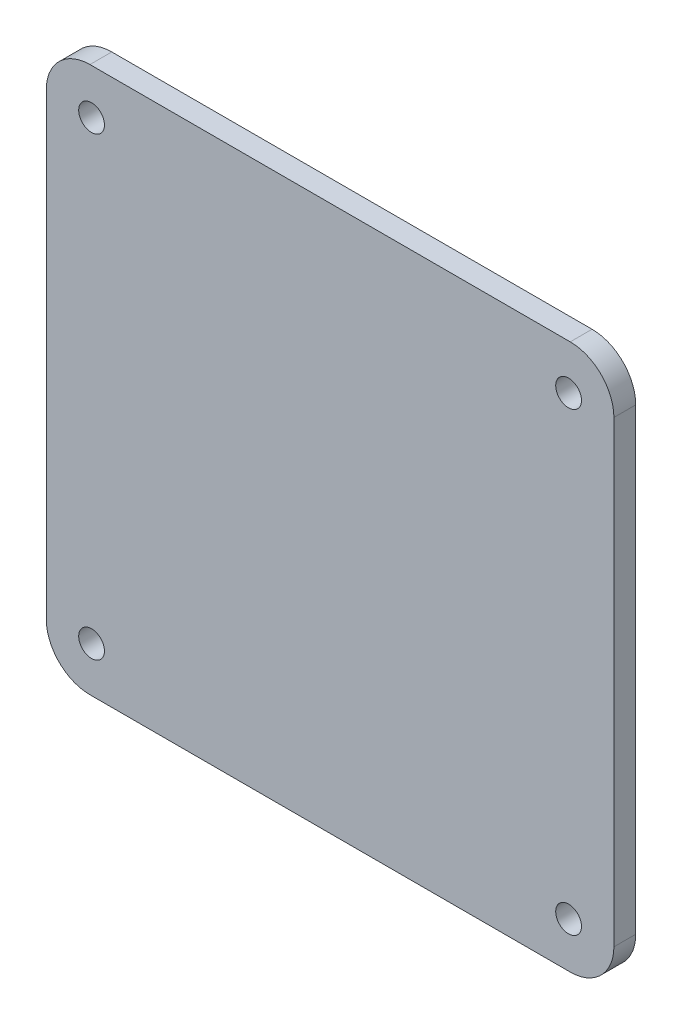
ISO-10303-21;
HEADER;
FILE_DESCRIPTION(('STEP AP214'),'2;1');
FILE_NAME('part.step','',(''),(''),'','','');
FILE_SCHEMA(('AUTOMOTIVE_DESIGN { 1 0 10303 214 1 1 1 1 }'));
ENDSEC;
DATA;
#1=APPLICATION_CONTEXT('core data for automotive mechanical design processes');
#2=APPLICATION_PROTOCOL_DEFINITION('international standard','automotive_design',2000,#1);
#3=PRODUCT_CONTEXT('',#1,'mechanical');
#4=PRODUCT('Part','Part','',(#3));
#5=PRODUCT_RELATED_PRODUCT_CATEGORY('part','',(#4));
#6=PRODUCT_DEFINITION_FORMATION('','',#4);
#7=PRODUCT_DEFINITION_CONTEXT('part definition',#1,'design');
#8=PRODUCT_DEFINITION('design','',#6,#7);
#9=PRODUCT_DEFINITION_SHAPE('','',#8);
#10=(LENGTH_UNIT() NAMED_UNIT(*) SI_UNIT(.MILLI.,.METRE.));
#11=(NAMED_UNIT(*) PLANE_ANGLE_UNIT() SI_UNIT($,.RADIAN.));
#12=(NAMED_UNIT(*) SI_UNIT($,.STERADIAN.) SOLID_ANGLE_UNIT());
#13=UNCERTAINTY_MEASURE_WITH_UNIT(LENGTH_MEASURE(1.E-05),#10,'distance_accuracy_value','');
#14=(GEOMETRIC_REPRESENTATION_CONTEXT(3) GLOBAL_UNCERTAINTY_ASSIGNED_CONTEXT((#13)) GLOBAL_UNIT_ASSIGNED_CONTEXT((#10,
#11,#12)) REPRESENTATION_CONTEXT('',''));
#15=CARTESIAN_POINT('',(0.,0.,0.));
#16=DIRECTION('',(0.,0.,1.));
#17=DIRECTION('',(1.,0.,0.));
#18=AXIS2_PLACEMENT_3D('',#15,#16,#17);
#19=CARTESIAN_POINT('',(-27.94,-26.67,2.54));
#20=DIRECTION('',(0.,0.,-1.));
#21=DIRECTION('',(-1.,0.,0.));
#22=AXIS2_PLACEMENT_3D('',#19,#20,#21);
#23=CYLINDRICAL_SURFACE('',#22,5.08);
#24=CARTESIAN_POINT('',(-27.94,-26.67,0.));
#25=DIRECTION('',(0.,0.,1.));
#26=DIRECTION('',(-1.,0.,0.));
#27=AXIS2_PLACEMENT_3D('',#24,#25,#26);
#28=CIRCLE('',#27,5.08);
#29=CARTESIAN_POINT('',(-33.02,-26.67,0.));
#30=VERTEX_POINT('',#29);
#31=CARTESIAN_POINT('',(-27.94,-31.75,0.));
#32=VERTEX_POINT('',#31);
#33=EDGE_CURVE('E145',#30,#32,#28,.T.);
#34=ORIENTED_EDGE('',*,*,#33,.T.);
#35=DIRECTION('',(0.,0.,-1.));
#36=VECTOR('',#35,1.);
#37=CARTESIAN_POINT('',(-27.94,-31.75,2.54));
#38=LINE('',#37,#36);
#39=CARTESIAN_POINT('',(-27.94,-31.75,2.54));
#40=VERTEX_POINT('',#39);
#41=EDGE_CURVE('E11',#40,#32,#38,.T.);
#42=ORIENTED_EDGE('',*,*,#41,.F.);
#43=CARTESIAN_POINT('',(-27.94,-26.67,2.54));
#44=DIRECTION('',(0.,0.,1.));
#45=DIRECTION('',(-1.,0.,0.));
#46=AXIS2_PLACEMENT_3D('',#43,#44,#45);
#47=CIRCLE('',#46,5.08);
#48=CARTESIAN_POINT('',(-33.02,-26.67,2.54));
#49=VERTEX_POINT('',#48);
#50=EDGE_CURVE('E168',#49,#40,#47,.T.);
#51=ORIENTED_EDGE('',*,*,#50,.F.);
#52=DIRECTION('',(0.,0.,-1.));
#53=VECTOR('',#52,1.);
#54=CARTESIAN_POINT('',(-33.02,-26.67,2.54));
#55=LINE('',#54,#53);
#56=EDGE_CURVE('E141',#49,#30,#55,.T.);
#57=ORIENTED_EDGE('',*,*,#56,.T.);
#58=EDGE_LOOP('',(#34,#42,#51,#57));
#59=FACE_BOUND('',#58,.T.);
#60=ADVANCED_FACE('F44',(#59),#23,.T.);
#61=CARTESIAN_POINT('',(-27.94,-31.75,2.54));
#62=DIRECTION('',(0.,1.,0.));
#63=DIRECTION('',(0.,0.,1.));
#64=AXIS2_PLACEMENT_3D('',#61,#62,#63);
#65=PLANE('',#64);
#66=DIRECTION('',(1.,0.,0.));
#67=VECTOR('',#66,1.);
#68=CARTESIAN_POINT('',(-27.94,-31.75,0.));
#69=LINE('',#68,#67);
#70=CARTESIAN_POINT('',(27.94,-31.75,0.));
#71=VERTEX_POINT('',#70);
#72=EDGE_CURVE('E149',#32,#71,#69,.T.);
#73=ORIENTED_EDGE('',*,*,#72,.T.);
#74=DIRECTION('',(0.,0.,-1.));
#75=VECTOR('',#74,1.);
#76=CARTESIAN_POINT('',(27.94,-31.75,2.54));
#77=LINE('',#76,#75);
#78=CARTESIAN_POINT('',(27.94,-31.75,2.54));
#79=VERTEX_POINT('',#78);
#80=EDGE_CURVE('E53',#79,#71,#77,.T.);
#81=ORIENTED_EDGE('',*,*,#80,.F.);
#82=DIRECTION('',(1.,0.,0.));
#83=VECTOR('',#82,1.);
#84=CARTESIAN_POINT('',(-27.94,-31.75,2.54));
#85=LINE('',#84,#83);
#86=EDGE_CURVE('E104',#40,#79,#85,.T.);
#87=ORIENTED_EDGE('',*,*,#86,.F.);
#88=ORIENTED_EDGE('',*,*,#41,.T.);
#89=EDGE_LOOP('',(#73,#81,#87,#88));
#90=FACE_BOUND('',#89,.T.);
#91=ADVANCED_FACE('F269',(#90),#65,.F.);
#92=CARTESIAN_POINT('',(27.94,-26.67,2.54));
#93=DIRECTION('',(0.,0.,-1.));
#94=DIRECTION('',(-1.,0.,0.));
#95=AXIS2_PLACEMENT_3D('',#92,#93,#94);
#96=CYLINDRICAL_SURFACE('',#95,5.08);
#97=CARTESIAN_POINT('',(27.94,-26.67,0.));
#98=DIRECTION('',(0.,0.,1.));
#99=DIRECTION('',(1.,0.,0.));
#100=AXIS2_PLACEMENT_3D('',#97,#98,#99);
#101=CIRCLE('',#100,5.08);
#102=CARTESIAN_POINT('',(33.02,-26.67,0.));
#103=VERTEX_POINT('',#102);
#104=EDGE_CURVE('E153',#71,#103,#101,.T.);
#105=ORIENTED_EDGE('',*,*,#104,.T.);
#106=DIRECTION('',(0.,0.,-1.));
#107=VECTOR('',#106,1.);
#108=CARTESIAN_POINT('',(33.02,-26.67,2.54));
#109=LINE('',#108,#107);
#110=CARTESIAN_POINT('',(33.02,-26.67,2.54));
#111=VERTEX_POINT('',#110);
#112=EDGE_CURVE('E179',#111,#103,#109,.T.);
#113=ORIENTED_EDGE('',*,*,#112,.F.);
#114=CARTESIAN_POINT('',(27.94,-26.67,2.54));
#115=DIRECTION('',(0.,0.,1.));
#116=DIRECTION('',(1.,0.,0.));
#117=AXIS2_PLACEMENT_3D('',#114,#115,#116);
#118=CIRCLE('',#117,5.08);
#119=EDGE_CURVE('E189',#79,#111,#118,.T.);
#120=ORIENTED_EDGE('',*,*,#119,.F.);
#121=ORIENTED_EDGE('',*,*,#80,.T.);
#122=EDGE_LOOP('',(#105,#113,#120,#121));
#123=FACE_BOUND('',#122,.T.);
#124=ADVANCED_FACE('F187',(#123),#96,.T.);
#125=CARTESIAN_POINT('',(33.02,-26.67,2.54));
#126=DIRECTION('',(-1.,0.,0.));
#127=DIRECTION('',(0.,0.,1.));
#128=AXIS2_PLACEMENT_3D('',#125,#126,#127);
#129=PLANE('',#128);
#130=DIRECTION('',(0.,1.,0.));
#131=VECTOR('',#130,1.);
#132=CARTESIAN_POINT('',(33.02,-26.67,0.));
#133=LINE('',#132,#131);
#134=CARTESIAN_POINT('',(33.02,26.67,0.));
#135=VERTEX_POINT('',#134);
#136=EDGE_CURVE('E156',#103,#135,#133,.T.);
#137=ORIENTED_EDGE('',*,*,#136,.T.);
#138=DIRECTION('',(0.,0.,-1.));
#139=VECTOR('',#138,1.);
#140=CARTESIAN_POINT('',(33.02,26.67,2.54));
#141=LINE('',#140,#139);
#142=CARTESIAN_POINT('',(33.02,26.67,2.54));
#143=VERTEX_POINT('',#142);
#144=EDGE_CURVE('E175',#143,#135,#141,.T.);
#145=ORIENTED_EDGE('',*,*,#144,.F.);
#146=DIRECTION('',(0.,1.,0.));
#147=VECTOR('',#146,1.);
#148=CARTESIAN_POINT('',(33.02,-26.67,2.54));
#149=LINE('',#148,#147);
#150=EDGE_CURVE('E202',#111,#143,#149,.T.);
#151=ORIENTED_EDGE('',*,*,#150,.F.);
#152=ORIENTED_EDGE('',*,*,#112,.T.);
#153=EDGE_LOOP('',(#137,#145,#151,#152));
#154=FACE_BOUND('',#153,.T.);
#155=ADVANCED_FACE('F197',(#154),#129,.F.);
#156=CARTESIAN_POINT('',(27.94,26.67,2.54));
#157=DIRECTION('',(0.,0.,-1.));
#158=DIRECTION('',(-1.,0.,0.));
#159=AXIS2_PLACEMENT_3D('',#156,#157,#158);
#160=CYLINDRICAL_SURFACE('',#159,5.08);
#161=CARTESIAN_POINT('',(27.94,26.67,0.));
#162=DIRECTION('',(0.,0.,1.));
#163=DIRECTION('',(-1.,0.,0.));
#164=AXIS2_PLACEMENT_3D('',#161,#162,#163);
#165=CIRCLE('',#164,5.08);
#166=CARTESIAN_POINT('',(27.94,31.75,0.));
#167=VERTEX_POINT('',#166);
#168=EDGE_CURVE('E159',#135,#167,#165,.T.);
#169=ORIENTED_EDGE('',*,*,#168,.T.);
#170=DIRECTION('',(0.,0.,-1.));
#171=VECTOR('',#170,1.);
#172=CARTESIAN_POINT('',(27.94,31.75,2.54));
#173=LINE('',#172,#171);
#174=CARTESIAN_POINT('',(27.94,31.75,2.54));
#175=VERTEX_POINT('',#174);
#176=EDGE_CURVE('E134',#175,#167,#173,.T.);
#177=ORIENTED_EDGE('',*,*,#176,.F.);
#178=CARTESIAN_POINT('',(27.94,26.67,2.54));
#179=DIRECTION('',(0.,0.,1.));
#180=DIRECTION('',(-1.,0.,0.));
#181=AXIS2_PLACEMENT_3D('',#178,#179,#180);
#182=CIRCLE('',#181,5.08);
#183=EDGE_CURVE('E123',#143,#175,#182,.T.);
#184=ORIENTED_EDGE('',*,*,#183,.F.);
#185=ORIENTED_EDGE('',*,*,#144,.T.);
#186=EDGE_LOOP('',(#169,#177,#184,#185));
#187=FACE_BOUND('',#186,.T.);
#188=ADVANCED_FACE('F200',(#187),#160,.T.);
#189=CARTESIAN_POINT('',(-27.94,31.75,2.54));
#190=DIRECTION('',(0.,-1.,0.));
#191=DIRECTION('',(0.,0.,-1.));
#192=AXIS2_PLACEMENT_3D('',#189,#190,#191);
#193=PLANE('',#192);
#194=DIRECTION('',(-1.,0.,0.));
#195=VECTOR('',#194,1.);
#196=CARTESIAN_POINT('',(-27.94,31.75,0.));
#197=LINE('',#196,#195);
#198=CARTESIAN_POINT('',(-27.94,31.75,0.));
#199=VERTEX_POINT('',#198);
#200=EDGE_CURVE('E132',#167,#199,#197,.T.);
#201=ORIENTED_EDGE('',*,*,#200,.T.);
#202=DIRECTION('',(0.,0.,-1.));
#203=VECTOR('',#202,1.);
#204=CARTESIAN_POINT('',(-27.94,31.75,2.54));
#205=LINE('',#204,#203);
#206=CARTESIAN_POINT('',(-27.94,31.75,2.54));
#207=VERTEX_POINT('',#206);
#208=EDGE_CURVE('E129',#207,#199,#205,.T.);
#209=ORIENTED_EDGE('',*,*,#208,.F.);
#210=DIRECTION('',(-1.,0.,0.));
#211=VECTOR('',#210,1.);
#212=CARTESIAN_POINT('',(-27.94,31.75,2.54));
#213=LINE('',#212,#211);
#214=EDGE_CURVE('E117',#175,#207,#213,.T.);
#215=ORIENTED_EDGE('',*,*,#214,.F.);
#216=ORIENTED_EDGE('',*,*,#176,.T.);
#217=EDGE_LOOP('',(#201,#209,#215,#216));
#218=FACE_BOUND('',#217,.T.);
#219=ADVANCED_FACE('F130',(#218),#193,.F.);
#220=CARTESIAN_POINT('',(-27.94,26.67,2.54));
#221=DIRECTION('',(0.,0.,-1.));
#222=DIRECTION('',(-1.,0.,0.));
#223=AXIS2_PLACEMENT_3D('',#220,#221,#222);
#224=CYLINDRICAL_SURFACE('',#223,5.08);
#225=CARTESIAN_POINT('',(-27.94,26.67,0.));
#226=DIRECTION('',(0.,0.,1.));
#227=DIRECTION('',(-1.,0.,0.));
#228=AXIS2_PLACEMENT_3D('',#225,#226,#227);
#229=CIRCLE('',#228,5.08);
#230=CARTESIAN_POINT('',(-33.02,26.67,0.));
#231=VERTEX_POINT('',#230);
#232=EDGE_CURVE('E90',#199,#231,#229,.T.);
#233=ORIENTED_EDGE('',*,*,#232,.T.);
#234=DIRECTION('',(0.,0.,-1.));
#235=VECTOR('',#234,1.);
#236=CARTESIAN_POINT('',(-33.02,26.67,2.54));
#237=LINE('',#236,#235);
#238=CARTESIAN_POINT('',(-33.02,26.67,2.54));
#239=VERTEX_POINT('',#238);
#240=EDGE_CURVE('E135',#239,#231,#237,.T.);
#241=ORIENTED_EDGE('',*,*,#240,.F.);
#242=CARTESIAN_POINT('',(-27.94,26.67,2.54));
#243=DIRECTION('',(0.,0.,1.));
#244=DIRECTION('',(-1.,0.,0.));
#245=AXIS2_PLACEMENT_3D('',#242,#243,#244);
#246=CIRCLE('',#245,5.08);
#247=EDGE_CURVE('E121',#207,#239,#246,.T.);
#248=ORIENTED_EDGE('',*,*,#247,.F.);
#249=ORIENTED_EDGE('',*,*,#208,.T.);
#250=EDGE_LOOP('',(#233,#241,#248,#249));
#251=FACE_BOUND('',#250,.T.);
#252=ADVANCED_FACE('F137',(#251),#224,.T.);
#253=CARTESIAN_POINT('',(-33.02,-26.67,2.54));
#254=DIRECTION('',(1.,0.,0.));
#255=DIRECTION('',(0.,0.,-1.));
#256=AXIS2_PLACEMENT_3D('',#253,#254,#255);
#257=PLANE('',#256);
#258=DIRECTION('',(0.,-1.,0.));
#259=VECTOR('',#258,1.);
#260=CARTESIAN_POINT('',(-33.02,-26.67,0.));
#261=LINE('',#260,#259);
#262=EDGE_CURVE('E96',#231,#30,#261,.T.);
#263=ORIENTED_EDGE('',*,*,#262,.T.);
#264=ORIENTED_EDGE('',*,*,#56,.F.);
#265=DIRECTION('',(0.,-1.,0.));
#266=VECTOR('',#265,1.);
#267=CARTESIAN_POINT('',(-33.02,-26.67,2.54));
#268=LINE('',#267,#266);
#269=EDGE_CURVE('E61',#239,#49,#268,.T.);
#270=ORIENTED_EDGE('',*,*,#269,.F.);
#271=ORIENTED_EDGE('',*,*,#240,.T.);
#272=EDGE_LOOP('',(#263,#264,#270,#271));
#273=FACE_BOUND('',#272,.T.);
#274=ADVANCED_FACE('F248',(#273),#257,.F.);
#275=CARTESIAN_POINT('',(-27.94,-26.67,2.54));
#276=DIRECTION('',(0.,0.,-1.));
#277=DIRECTION('',(-1.,0.,0.));
#278=AXIS2_PLACEMENT_3D('',#275,#276,#277);
#279=PLANE('',#278);
#280=CARTESIAN_POINT('',(27.75,26.5,2.54));
#281=DIRECTION('',(0.,0.,1.));
#282=DIRECTION('',(1.,0.,0.));
#283=AXIS2_PLACEMENT_3D('',#280,#281,#282);
#284=CIRCLE('',#283,1.5);
#285=CARTESIAN_POINT('',(29.25,26.5,2.54));
#286=VERTEX_POINT('',#285);
#287=EDGE_CURVE('E216',#286,#286,#284,.T.);
#288=ORIENTED_EDGE('',*,*,#287,.F.);
#289=EDGE_LOOP('',(#288));
#290=FACE_BOUND('',#289,.T.);
#291=CARTESIAN_POINT('',(-27.75,-26.5,2.54));
#292=DIRECTION('',(0.,0.,1.));
#293=DIRECTION('',(1.,0.,0.));
#294=AXIS2_PLACEMENT_3D('',#291,#292,#293);
#295=CIRCLE('',#294,1.5);
#296=CARTESIAN_POINT('',(-26.25,-26.5,2.54));
#297=VERTEX_POINT('',#296);
#298=EDGE_CURVE('E224',#297,#297,#295,.T.);
#299=ORIENTED_EDGE('',*,*,#298,.F.);
#300=EDGE_LOOP('',(#299));
#301=FACE_BOUND('',#300,.T.);
#302=CARTESIAN_POINT('',(27.75,-26.5,2.54));
#303=DIRECTION('',(0.,0.,1.));
#304=DIRECTION('',(1.,0.,0.));
#305=AXIS2_PLACEMENT_3D('',#302,#303,#304);
#306=CIRCLE('',#305,1.5);
#307=CARTESIAN_POINT('',(29.25,-26.5,2.54));
#308=VERTEX_POINT('',#307);
#309=EDGE_CURVE('E225',#308,#308,#306,.T.);
#310=ORIENTED_EDGE('',*,*,#309,.F.);
#311=EDGE_LOOP('',(#310));
#312=FACE_BOUND('',#311,.T.);
#313=CARTESIAN_POINT('',(-27.75,26.5,2.54));
#314=DIRECTION('',(0.,0.,1.));
#315=DIRECTION('',(1.,0.,0.));
#316=AXIS2_PLACEMENT_3D('',#313,#314,#315);
#317=CIRCLE('',#316,1.5);
#318=CARTESIAN_POINT('',(-26.25,26.5,2.54));
#319=VERTEX_POINT('',#318);
#320=EDGE_CURVE('E212',#319,#319,#317,.T.);
#321=ORIENTED_EDGE('',*,*,#320,.F.);
#322=EDGE_LOOP('',(#321));
#323=FACE_BOUND('',#322,.T.);
#324=ORIENTED_EDGE('',*,*,#50,.T.);
#325=ORIENTED_EDGE('',*,*,#86,.T.);
#326=ORIENTED_EDGE('',*,*,#119,.T.);
#327=ORIENTED_EDGE('',*,*,#150,.T.);
#328=ORIENTED_EDGE('',*,*,#183,.T.);
#329=ORIENTED_EDGE('',*,*,#214,.T.);
#330=ORIENTED_EDGE('',*,*,#247,.T.);
#331=ORIENTED_EDGE('',*,*,#269,.T.);
#332=EDGE_LOOP('',(#324,#325,#326,#327,#328,#329,#330,#331));
#333=FACE_BOUND('',#332,.T.);
#334=ADVANCED_FACE('F119',(#290,#301,#312,#323,#333),#279,.F.);
#335=CARTESIAN_POINT('',(-27.94,-26.67,0.));
#336=DIRECTION('',(0.,0.,-1.));
#337=DIRECTION('',(-1.,0.,0.));
#338=AXIS2_PLACEMENT_3D('',#335,#336,#337);
#339=PLANE('',#338);
#340=CARTESIAN_POINT('',(27.75,26.5,0.));
#341=DIRECTION('',(0.,0.,1.));
#342=DIRECTION('',(1.,0.,0.));
#343=AXIS2_PLACEMENT_3D('',#340,#341,#342);
#344=CIRCLE('',#343,1.5);
#345=CARTESIAN_POINT('',(29.25,26.5,0.));
#346=VERTEX_POINT('',#345);
#347=EDGE_CURVE('E229',#346,#346,#344,.T.);
#348=ORIENTED_EDGE('',*,*,#347,.T.);
#349=EDGE_LOOP('',(#348));
#350=FACE_BOUND('',#349,.T.);
#351=CARTESIAN_POINT('',(-27.75,-26.5,0.));
#352=DIRECTION('',(0.,0.,1.));
#353=DIRECTION('',(1.,0.,0.));
#354=AXIS2_PLACEMENT_3D('',#351,#352,#353);
#355=CIRCLE('',#354,1.5);
#356=CARTESIAN_POINT('',(-26.25,-26.5,0.));
#357=VERTEX_POINT('',#356);
#358=EDGE_CURVE('E220',#357,#357,#355,.T.);
#359=ORIENTED_EDGE('',*,*,#358,.T.);
#360=EDGE_LOOP('',(#359));
#361=FACE_BOUND('',#360,.T.);
#362=CARTESIAN_POINT('',(27.75,-26.5,0.));
#363=DIRECTION('',(0.,0.,1.));
#364=DIRECTION('',(1.,0.,0.));
#365=AXIS2_PLACEMENT_3D('',#362,#363,#364);
#366=CIRCLE('',#365,1.5);
#367=CARTESIAN_POINT('',(29.25,-26.5,0.));
#368=VERTEX_POINT('',#367);
#369=EDGE_CURVE('E236',#368,#368,#366,.T.);
#370=ORIENTED_EDGE('',*,*,#369,.T.);
#371=EDGE_LOOP('',(#370));
#372=FACE_BOUND('',#371,.T.);
#373=CARTESIAN_POINT('',(-27.75,26.5,0.));
#374=DIRECTION('',(0.,0.,1.));
#375=DIRECTION('',(1.,0.,0.));
#376=AXIS2_PLACEMENT_3D('',#373,#374,#375);
#377=CIRCLE('',#376,1.5);
#378=CARTESIAN_POINT('',(-26.25,26.5,0.));
#379=VERTEX_POINT('',#378);
#380=EDGE_CURVE('E150',#379,#379,#377,.T.);
#381=ORIENTED_EDGE('',*,*,#380,.T.);
#382=EDGE_LOOP('',(#381));
#383=FACE_BOUND('',#382,.T.);
#384=ORIENTED_EDGE('',*,*,#33,.F.);
#385=ORIENTED_EDGE('',*,*,#262,.F.);
#386=ORIENTED_EDGE('',*,*,#232,.F.);
#387=ORIENTED_EDGE('',*,*,#200,.F.);
#388=ORIENTED_EDGE('',*,*,#168,.F.);
#389=ORIENTED_EDGE('',*,*,#136,.F.);
#390=ORIENTED_EDGE('',*,*,#104,.F.);
#391=ORIENTED_EDGE('',*,*,#72,.F.);
#392=EDGE_LOOP('',(#384,#385,#386,#387,#388,#389,#390,#391));
#393=FACE_BOUND('',#392,.T.);
#394=ADVANCED_FACE('F193',(#350,#361,#372,#383,#393),#339,.T.);
#395=CARTESIAN_POINT('',(-27.75,26.5,0.));
#396=DIRECTION('',(0.,0.,1.));
#397=DIRECTION('',(1.,0.,0.));
#398=AXIS2_PLACEMENT_3D('',#395,#396,#397);
#399=CYLINDRICAL_SURFACE('',#398,1.5);
#400=ORIENTED_EDGE('',*,*,#380,.F.);
#401=EDGE_LOOP('',(#400));
#402=FACE_BOUND('',#401,.T.);
#403=ORIENTED_EDGE('',*,*,#320,.T.);
#404=EDGE_LOOP('',(#403));
#405=FACE_BOUND('',#404,.T.);
#406=ADVANCED_FACE('F253',(#402,#405),#399,.F.);
#407=CARTESIAN_POINT('',(27.75,-26.5,0.));
#408=DIRECTION('',(0.,0.,1.));
#409=DIRECTION('',(1.,0.,0.));
#410=AXIS2_PLACEMENT_3D('',#407,#408,#409);
#411=CYLINDRICAL_SURFACE('',#410,1.5);
#412=ORIENTED_EDGE('',*,*,#369,.F.);
#413=EDGE_LOOP('',(#412));
#414=FACE_BOUND('',#413,.T.);
#415=ORIENTED_EDGE('',*,*,#309,.T.);
#416=EDGE_LOOP('',(#415));
#417=FACE_BOUND('',#416,.T.);
#418=ADVANCED_FACE('F244',(#414,#417),#411,.F.);
#419=CARTESIAN_POINT('',(-27.75,-26.5,0.));
#420=DIRECTION('',(0.,0.,1.));
#421=DIRECTION('',(1.,0.,0.));
#422=AXIS2_PLACEMENT_3D('',#419,#420,#421);
#423=CYLINDRICAL_SURFACE('',#422,1.5);
#424=ORIENTED_EDGE('',*,*,#358,.F.);
#425=EDGE_LOOP('',(#424));
#426=FACE_BOUND('',#425,.T.);
#427=ORIENTED_EDGE('',*,*,#298,.T.);
#428=EDGE_LOOP('',(#427));
#429=FACE_BOUND('',#428,.T.);
#430=ADVANCED_FACE('F261',(#426,#429),#423,.F.);
#431=CARTESIAN_POINT('',(27.75,26.5,0.));
#432=DIRECTION('',(0.,0.,1.));
#433=DIRECTION('',(1.,0.,0.));
#434=AXIS2_PLACEMENT_3D('',#431,#432,#433);
#435=CYLINDRICAL_SURFACE('',#434,1.5);
#436=ORIENTED_EDGE('',*,*,#347,.F.);
#437=EDGE_LOOP('',(#436));
#438=FACE_BOUND('',#437,.T.);
#439=ORIENTED_EDGE('',*,*,#287,.T.);
#440=EDGE_LOOP('',(#439));
#441=FACE_BOUND('',#440,.T.);
#442=ADVANCED_FACE('F350',(#438,#441),#435,.F.);
#443=CLOSED_SHELL('',(#60,#91,#124,#155,#188,#219,#252,#274,#334,#394,#406,#418,#430,#442));
#444=MANIFOLD_SOLID_BREP('B2',#443);
#445=ADVANCED_BREP_SHAPE_REPRESENTATION('',(#18,#444),#14);
#446=SHAPE_DEFINITION_REPRESENTATION(#9,#445);
ENDSEC;
END-ISO-10303-21;
